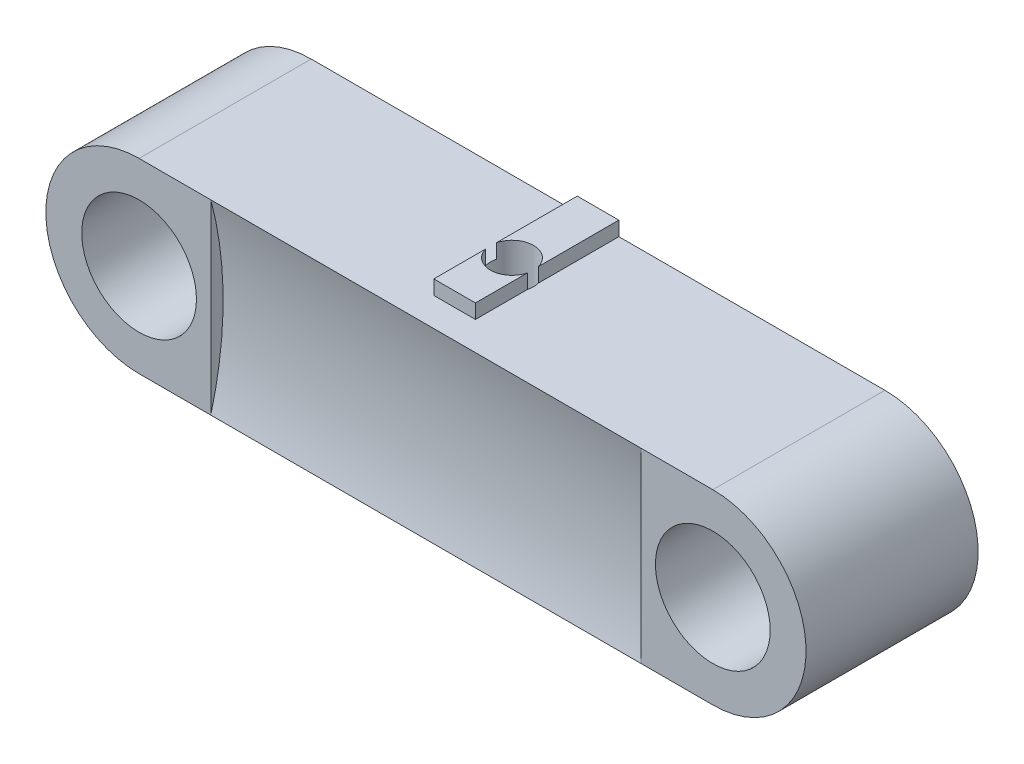
ISO-10303-21;
HEADER;
FILE_DESCRIPTION(('STEP AP214'),'2;1');
FILE_NAME('part.step','',(''),(''),'','','');
FILE_SCHEMA(('AUTOMOTIVE_DESIGN { 1 0 10303 214 1 1 1 1 }'));
ENDSEC;
DATA;
#1=APPLICATION_CONTEXT('core data for automotive mechanical design processes');
#2=APPLICATION_PROTOCOL_DEFINITION('international standard','automotive_design',2000,#1);
#3=PRODUCT_CONTEXT('',#1,'mechanical');
#4=PRODUCT('Part','Part','',(#3));
#5=PRODUCT_RELATED_PRODUCT_CATEGORY('part','',(#4));
#6=PRODUCT_DEFINITION_FORMATION('','',#4);
#7=PRODUCT_DEFINITION_CONTEXT('part definition',#1,'design');
#8=PRODUCT_DEFINITION('design','',#6,#7);
#9=PRODUCT_DEFINITION_SHAPE('','',#8);
#10=(LENGTH_UNIT() NAMED_UNIT(*) SI_UNIT(.MILLI.,.METRE.));
#11=(NAMED_UNIT(*) PLANE_ANGLE_UNIT() SI_UNIT($,.RADIAN.));
#12=(NAMED_UNIT(*) SI_UNIT($,.STERADIAN.) SOLID_ANGLE_UNIT());
#13=UNCERTAINTY_MEASURE_WITH_UNIT(LENGTH_MEASURE(1.E-05),#10,'distance_accuracy_value','');
#14=(GEOMETRIC_REPRESENTATION_CONTEXT(3) GLOBAL_UNCERTAINTY_ASSIGNED_CONTEXT((#13)) GLOBAL_UNIT_ASSIGNED_CONTEXT((#10,
#11,#12)) REPRESENTATION_CONTEXT('',''));
#15=CARTESIAN_POINT('',(0.,0.,0.));
#16=DIRECTION('',(0.,0.,1.));
#17=DIRECTION('',(1.,0.,0.));
#18=AXIS2_PLACEMENT_3D('',#15,#16,#17);
#19=CARTESIAN_POINT('',(-1.45,7.5,-6.));
#20=DIRECTION('',(1.,0.,0.));
#21=DIRECTION('',(0.,0.,-1.));
#22=AXIS2_PLACEMENT_3D('',#19,#20,#21);
#23=PLANE('',#22);
#24=DIRECTION('',(0.,0.,1.));
#25=VECTOR('',#24,1.);
#26=CARTESIAN_POINT('',(-1.45,6.5,6.));
#27=LINE('',#26,#25);
#28=CARTESIAN_POINT('',(-1.45,6.5,-6.));
#29=VERTEX_POINT('',#28);
#30=CARTESIAN_POINT('',(-1.45,6.5,-0.384057287393435));
#31=VERTEX_POINT('',#30);
#32=EDGE_CURVE('E138',#29,#31,#27,.T.);
#33=ORIENTED_EDGE('',*,*,#32,.T.);
#34=DIRECTION('',(0.,1.,0.));
#35=VECTOR('',#34,1.);
#36=CARTESIAN_POINT('',(-1.45,-6.5,-0.384057287393429));
#37=LINE('',#36,#35);
#38=CARTESIAN_POINT('',(-1.45,7.5,-0.384057287393429));
#39=VERTEX_POINT('',#38);
#40=EDGE_CURVE('E244',#31,#39,#37,.T.);
#41=ORIENTED_EDGE('',*,*,#40,.T.);
#42=DIRECTION('',(0.,0.,1.));
#43=VECTOR('',#42,1.);
#44=CARTESIAN_POINT('',(-1.45,7.5,-6.));
#45=LINE('',#44,#43);
#46=CARTESIAN_POINT('',(-1.45,7.5,-6.));
#47=VERTEX_POINT('',#46);
#48=EDGE_CURVE('E298',#47,#39,#45,.T.);
#49=ORIENTED_EDGE('',*,*,#48,.F.);
#50=DIRECTION('',(0.,-1.,0.));
#51=VECTOR('',#50,1.);
#52=CARTESIAN_POINT('',(-1.45,7.5,-6.));
#53=LINE('',#52,#51);
#54=EDGE_CURVE('E155',#47,#29,#53,.T.);
#55=ORIENTED_EDGE('',*,*,#54,.T.);
#56=EDGE_LOOP('',(#33,#41,#49,#55));
#57=FACE_BOUND('',#56,.T.);
#58=ADVANCED_FACE('F33',(#57),#23,.F.);
#59=CARTESIAN_POINT('',(1.45,7.5,-6.));
#60=DIRECTION('',(-1.,0.,0.));
#61=DIRECTION('',(0.,0.,1.));
#62=AXIS2_PLACEMENT_3D('',#59,#60,#61);
#63=PLANE('',#62);
#64=DIRECTION('',(0.,0.,-1.));
#65=VECTOR('',#64,1.);
#66=CARTESIAN_POINT('',(1.45,6.5,6.));
#67=LINE('',#66,#65);
#68=CARTESIAN_POINT('',(1.45,6.5,4.));
#69=VERTEX_POINT('',#68);
#70=CARTESIAN_POINT('',(1.45,6.5,0.384057287393435));
#71=VERTEX_POINT('',#70);
#72=EDGE_CURVE('E145',#69,#71,#67,.T.);
#73=ORIENTED_EDGE('',*,*,#72,.T.);
#74=DIRECTION('',(0.,1.,0.));
#75=VECTOR('',#74,1.);
#76=CARTESIAN_POINT('',(1.45,-6.5,0.384057287393428));
#77=LINE('',#76,#75);
#78=CARTESIAN_POINT('',(1.45,7.5,0.384057287393428));
#79=VERTEX_POINT('',#78);
#80=EDGE_CURVE('E133',#71,#79,#77,.T.);
#81=ORIENTED_EDGE('',*,*,#80,.T.);
#82=DIRECTION('',(0.,0.,-1.));
#83=VECTOR('',#82,1.);
#84=CARTESIAN_POINT('',(1.45,7.5,-6.));
#85=LINE('',#84,#83);
#86=CARTESIAN_POINT('',(1.45,7.5,4.));
#87=VERTEX_POINT('',#86);
#88=EDGE_CURVE('E144',#87,#79,#85,.T.);
#89=ORIENTED_EDGE('',*,*,#88,.F.);
#90=DIRECTION('',(0.,-1.,0.));
#91=VECTOR('',#90,1.);
#92=CARTESIAN_POINT('',(1.45,7.5,4.));
#93=LINE('',#92,#91);
#94=EDGE_CURVE('E165',#87,#69,#93,.T.);
#95=ORIENTED_EDGE('',*,*,#94,.T.);
#96=EDGE_LOOP('',(#73,#81,#89,#95));
#97=FACE_BOUND('',#96,.T.);
#98=ADVANCED_FACE('F142',(#97),#63,.F.);
#99=CARTESIAN_POINT('',(0.,7.5,0.));
#100=DIRECTION('',(0.,1.,0.));
#101=DIRECTION('',(0.,0.,1.));
#102=AXIS2_PLACEMENT_3D('',#99,#100,#101);
#103=PLANE('',#102);
#104=CARTESIAN_POINT('',(0.,7.5,0.));
#105=DIRECTION('',(0.,1.,0.));
#106=DIRECTION('',(0.,0.,1.));
#107=AXIS2_PLACEMENT_3D('',#104,#105,#106);
#108=CIRCLE('',#107,1.5);
#109=CARTESIAN_POINT('',(1.45,7.5,-0.384057287393429));
#110=VERTEX_POINT('',#109);
#111=EDGE_CURVE('E11',#110,#39,#108,.T.);
#112=ORIENTED_EDGE('',*,*,#111,.F.);
#113=CARTESIAN_POINT('',(1.45,7.5,-6.));
#114=VERTEX_POINT('',#113);
#115=EDGE_CURVE('E153',#110,#114,#85,.T.);
#116=ORIENTED_EDGE('',*,*,#115,.T.);
#117=DIRECTION('',(-1.,0.,0.));
#118=VECTOR('',#117,1.);
#119=CARTESIAN_POINT('',(-1.45,7.5,-6.));
#120=LINE('',#119,#118);
#121=EDGE_CURVE('E152',#114,#47,#120,.T.);
#122=ORIENTED_EDGE('',*,*,#121,.T.);
#123=ORIENTED_EDGE('',*,*,#48,.T.);
#124=EDGE_LOOP('',(#112,#116,#122,#123));
#125=FACE_BOUND('',#124,.T.);
#126=ADVANCED_FACE('F277',(#125),#103,.T.);
#127=CARTESIAN_POINT('',(-20.,6.5,6.));
#128=DIRECTION('',(0.,-1.,0.));
#129=DIRECTION('',(1.,0.,0.));
#130=AXIS2_PLACEMENT_3D('',#127,#128,#129);
#131=PLANE('',#130);
#132=CARTESIAN_POINT('',(-1.45,6.5,0.384057287393428));
#133=VERTEX_POINT('',#132);
#134=CARTESIAN_POINT('',(-1.45,6.5,4.));
#135=VERTEX_POINT('',#134);
#136=EDGE_CURVE('E55',#133,#135,#27,.T.);
#137=ORIENTED_EDGE('',*,*,#136,.F.);
#138=CARTESIAN_POINT('',(0.,6.5,0.));
#139=DIRECTION('',(0.,-1.,0.));
#140=DIRECTION('',(1.,0.,0.));
#141=AXIS2_PLACEMENT_3D('',#138,#139,#140);
#142=CIRCLE('',#141,1.5);
#143=EDGE_CURVE('E251',#133,#31,#142,.T.);
#144=ORIENTED_EDGE('',*,*,#143,.T.);
#145=ORIENTED_EDGE('',*,*,#32,.F.);
#146=DIRECTION('',(-1.,0.,0.));
#147=VECTOR('',#146,1.);
#148=CARTESIAN_POINT('',(-20.,6.5,-6.));
#149=LINE('',#148,#147);
#150=CARTESIAN_POINT('',(-20.,6.5,-6.));
#151=VERTEX_POINT('',#150);
#152=EDGE_CURVE('E221',#29,#151,#149,.T.);
#153=ORIENTED_EDGE('',*,*,#152,.T.);
#154=DIRECTION('',(0.,0.,-1.));
#155=VECTOR('',#154,1.);
#156=CARTESIAN_POINT('',(-20.,6.5,6.));
#157=LINE('',#156,#155);
#158=CARTESIAN_POINT('',(-20.,6.5,6.));
#159=VERTEX_POINT('',#158);
#160=EDGE_CURVE('E214',#159,#151,#157,.T.);
#161=ORIENTED_EDGE('',*,*,#160,.F.);
#162=DIRECTION('',(-1.,0.,0.));
#163=VECTOR('',#162,1.);
#164=CARTESIAN_POINT('',(-20.,6.5,6.));
#165=LINE('',#164,#163);
#166=CARTESIAN_POINT('',(-15.,6.5,6.));
#167=VERTEX_POINT('',#166);
#168=EDGE_CURVE('E210',#167,#159,#165,.T.);
#169=ORIENTED_EDGE('',*,*,#168,.F.);
#170=DIRECTION('',(1.,0.,0.));
#171=VECTOR('',#170,1.);
#172=CARTESIAN_POINT('',(-15.,6.5,6.));
#173=LINE('',#172,#171);
#174=CARTESIAN_POINT('',(15.,6.50000000000001,6.));
#175=VERTEX_POINT('',#174);
#176=EDGE_CURVE('E178',#167,#175,#173,.T.);
#177=ORIENTED_EDGE('',*,*,#176,.T.);
#178=CARTESIAN_POINT('',(20.,6.50000000000001,6.));
#179=VERTEX_POINT('',#178);
#180=EDGE_CURVE('E211',#179,#175,#165,.T.);
#181=ORIENTED_EDGE('',*,*,#180,.F.);
#182=DIRECTION('',(0.,0.,-1.));
#183=VECTOR('',#182,1.);
#184=CARTESIAN_POINT('',(20.,6.50000000000001,6.));
#185=LINE('',#184,#183);
#186=CARTESIAN_POINT('',(20.,6.50000000000001,-6.));
#187=VERTEX_POINT('',#186);
#188=EDGE_CURVE('E226',#179,#187,#185,.T.);
#189=ORIENTED_EDGE('',*,*,#188,.T.);
#190=CARTESIAN_POINT('',(1.45,6.5,-6.));
#191=VERTEX_POINT('',#190);
#192=EDGE_CURVE('E204',#187,#191,#149,.T.);
#193=ORIENTED_EDGE('',*,*,#192,.T.);
#194=CARTESIAN_POINT('',(1.45,6.5,-0.384057287393429));
#195=VERTEX_POINT('',#194);
#196=EDGE_CURVE('E235',#195,#191,#67,.T.);
#197=ORIENTED_EDGE('',*,*,#196,.F.);
#198=EDGE_CURVE('E146',#195,#71,#142,.T.);
#199=ORIENTED_EDGE('',*,*,#198,.T.);
#200=ORIENTED_EDGE('',*,*,#72,.F.);
#201=DIRECTION('',(1.,0.,0.));
#202=VECTOR('',#201,1.);
#203=CARTESIAN_POINT('',(-20.,6.5,4.));
#204=LINE('',#203,#202);
#205=EDGE_CURVE('E237',#135,#69,#204,.T.);
#206=ORIENTED_EDGE('',*,*,#205,.F.);
#207=EDGE_LOOP('',(#137,#144,#145,#153,#161,#169,#177,#181,#189,#193,#197,#199,#200,#206));
#208=FACE_BOUND('',#207,.T.);
#209=ADVANCED_FACE('F249',(#208),#131,.F.);
#210=CARTESIAN_POINT('',(-20.,0.,6.));
#211=DIRECTION('',(0.,0.,1.));
#212=DIRECTION('',(1.,0.,0.));
#213=AXIS2_PLACEMENT_3D('',#210,#211,#212);
#214=PLANE('',#213);
#215=CARTESIAN_POINT('',(-20.,0.,6.));
#216=DIRECTION('',(0.,0.,1.));
#217=DIRECTION('',(1.,0.,0.));
#218=AXIS2_PLACEMENT_3D('',#215,#216,#217);
#219=CIRCLE('',#218,4.);
#220=CARTESIAN_POINT('',(-16.,0.,6.));
#221=VERTEX_POINT('',#220);
#222=EDGE_CURVE('E194',#221,#221,#219,.T.);
#223=ORIENTED_EDGE('',*,*,#222,.F.);
#224=EDGE_LOOP('',(#223));
#225=FACE_BOUND('',#224,.T.);
#226=DIRECTION('',(1.,0.,0.));
#227=VECTOR('',#226,1.);
#228=CARTESIAN_POINT('',(-20.,-6.5,6.));
#229=LINE('',#228,#227);
#230=CARTESIAN_POINT('',(-20.,-6.5,6.));
#231=VERTEX_POINT('',#230);
#232=CARTESIAN_POINT('',(-15.,-6.5,6.));
#233=VERTEX_POINT('',#232);
#234=EDGE_CURVE('E205',#231,#233,#229,.T.);
#235=ORIENTED_EDGE('',*,*,#234,.T.);
#236=DIRECTION('',(0.,-1.,0.));
#237=VECTOR('',#236,1.);
#238=CARTESIAN_POINT('',(-15.,6.5,6.));
#239=LINE('',#238,#237);
#240=EDGE_CURVE('E174',#167,#233,#239,.T.);
#241=ORIENTED_EDGE('',*,*,#240,.F.);
#242=ORIENTED_EDGE('',*,*,#168,.T.);
#243=CARTESIAN_POINT('',(-20.,0.,6.));
#244=DIRECTION('',(0.,0.,1.));
#245=DIRECTION('',(1.,0.,0.));
#246=AXIS2_PLACEMENT_3D('',#243,#244,#245);
#247=CIRCLE('',#246,6.5);
#248=EDGE_CURVE('E200',#159,#231,#247,.T.);
#249=ORIENTED_EDGE('',*,*,#248,.T.);
#250=EDGE_LOOP('',(#235,#241,#242,#249));
#251=FACE_BOUND('',#250,.T.);
#252=ADVANCED_FACE('F315',(#225,#251),#214,.T.);
#253=DIRECTION('',(0.,-1.,0.));
#254=VECTOR('',#253,1.);
#255=CARTESIAN_POINT('',(15.,6.5,6.));
#256=LINE('',#255,#254);
#257=CARTESIAN_POINT('',(15.,-6.5,6.));
#258=VERTEX_POINT('',#257);
#259=EDGE_CURVE('E175',#175,#258,#256,.T.);
#260=ORIENTED_EDGE('',*,*,#259,.T.);
#261=CARTESIAN_POINT('',(20.,-6.49999999999999,6.));
#262=VERTEX_POINT('',#261);
#263=EDGE_CURVE('E203',#258,#262,#229,.T.);
#264=ORIENTED_EDGE('',*,*,#263,.T.);
#265=CARTESIAN_POINT('',(20.,0.,6.));
#266=DIRECTION('',(0.,0.,1.));
#267=DIRECTION('',(1.,0.,0.));
#268=AXIS2_PLACEMENT_3D('',#265,#266,#267);
#269=CIRCLE('',#268,6.5);
#270=EDGE_CURVE('E208',#262,#179,#269,.T.);
#271=ORIENTED_EDGE('',*,*,#270,.T.);
#272=ORIENTED_EDGE('',*,*,#180,.T.);
#273=EDGE_LOOP('',(#260,#264,#271,#272));
#274=FACE_BOUND('',#273,.T.);
#275=CARTESIAN_POINT('',(20.,0.,6.));
#276=DIRECTION('',(0.,0.,1.));
#277=DIRECTION('',(1.,0.,0.));
#278=AXIS2_PLACEMENT_3D('',#275,#276,#277);
#279=CIRCLE('',#278,4.);
#280=CARTESIAN_POINT('',(24.,0.,6.));
#281=VERTEX_POINT('',#280);
#282=EDGE_CURVE('E188',#281,#281,#279,.T.);
#283=ORIENTED_EDGE('',*,*,#282,.F.);
#284=EDGE_LOOP('',(#283));
#285=FACE_BOUND('',#284,.T.);
#286=ADVANCED_FACE('F324',(#274,#285),#214,.T.);
#287=CARTESIAN_POINT('',(-20.,0.,-6.));
#288=DIRECTION('',(0.,0.,1.));
#289=DIRECTION('',(1.,0.,0.));
#290=AXIS2_PLACEMENT_3D('',#287,#288,#289);
#291=PLANE('',#290);
#292=ORIENTED_EDGE('',*,*,#152,.F.);
#293=ORIENTED_EDGE('',*,*,#54,.F.);
#294=ORIENTED_EDGE('',*,*,#121,.F.);
#295=DIRECTION('',(0.,-1.,0.));
#296=VECTOR('',#295,1.);
#297=CARTESIAN_POINT('',(1.45,7.5,-6.));
#298=LINE('',#297,#296);
#299=EDGE_CURVE('E162',#114,#191,#298,.T.);
#300=ORIENTED_EDGE('',*,*,#299,.T.);
#301=ORIENTED_EDGE('',*,*,#192,.F.);
#302=CARTESIAN_POINT('',(20.,0.,-6.));
#303=DIRECTION('',(0.,0.,1.));
#304=DIRECTION('',(1.,0.,0.));
#305=AXIS2_PLACEMENT_3D('',#302,#303,#304);
#306=CIRCLE('',#305,6.5);
#307=CARTESIAN_POINT('',(20.,-6.49999999999999,-6.));
#308=VERTEX_POINT('',#307);
#309=EDGE_CURVE('E219',#308,#187,#306,.T.);
#310=ORIENTED_EDGE('',*,*,#309,.F.);
#311=DIRECTION('',(1.,0.,0.));
#312=VECTOR('',#311,1.);
#313=CARTESIAN_POINT('',(-20.,-6.5,-6.));
#314=LINE('',#313,#312);
#315=CARTESIAN_POINT('',(-20.,-6.5,-6.));
#316=VERTEX_POINT('',#315);
#317=EDGE_CURVE('E217',#316,#308,#314,.T.);
#318=ORIENTED_EDGE('',*,*,#317,.F.);
#319=CARTESIAN_POINT('',(-20.,0.,-6.));
#320=DIRECTION('',(0.,0.,1.));
#321=DIRECTION('',(1.,0.,0.));
#322=AXIS2_PLACEMENT_3D('',#319,#320,#321);
#323=CIRCLE('',#322,6.5);
#324=EDGE_CURVE('E197',#151,#316,#323,.T.);
#325=ORIENTED_EDGE('',*,*,#324,.F.);
#326=EDGE_LOOP('',(#292,#293,#294,#300,#301,#310,#318,#325));
#327=FACE_BOUND('',#326,.T.);
#328=CARTESIAN_POINT('',(20.,0.,-6.));
#329=DIRECTION('',(0.,0.,1.));
#330=DIRECTION('',(1.,0.,0.));
#331=AXIS2_PLACEMENT_3D('',#328,#329,#330);
#332=CIRCLE('',#331,4.);
#333=CARTESIAN_POINT('',(24.,0.,-6.));
#334=VERTEX_POINT('',#333);
#335=EDGE_CURVE('E185',#334,#334,#332,.T.);
#336=ORIENTED_EDGE('',*,*,#335,.T.);
#337=EDGE_LOOP('',(#336));
#338=FACE_BOUND('',#337,.T.);
#339=CARTESIAN_POINT('',(-20.,0.,-6.));
#340=DIRECTION('',(0.,0.,1.));
#341=DIRECTION('',(1.,0.,0.));
#342=AXIS2_PLACEMENT_3D('',#339,#340,#341);
#343=CIRCLE('',#342,4.);
#344=CARTESIAN_POINT('',(-16.,0.,-6.));
#345=VERTEX_POINT('',#344);
#346=EDGE_CURVE('E191',#345,#345,#343,.T.);
#347=ORIENTED_EDGE('',*,*,#346,.T.);
#348=EDGE_LOOP('',(#347));
#349=FACE_BOUND('',#348,.T.);
#350=ADVANCED_FACE('F304',(#327,#338,#349),#291,.F.);
#351=CARTESIAN_POINT('',(-20.,0.,6.));
#352=DIRECTION('',(0.,0.,-1.));
#353=DIRECTION('',(-1.,0.,0.));
#354=AXIS2_PLACEMENT_3D('',#351,#352,#353);
#355=CYLINDRICAL_SURFACE('',#354,6.5);
#356=ORIENTED_EDGE('',*,*,#324,.T.);
#357=DIRECTION('',(0.,0.,-1.));
#358=VECTOR('',#357,1.);
#359=CARTESIAN_POINT('',(-20.,-6.5,6.));
#360=LINE('',#359,#358);
#361=EDGE_CURVE('E232',#231,#316,#360,.T.);
#362=ORIENTED_EDGE('',*,*,#361,.F.);
#363=ORIENTED_EDGE('',*,*,#248,.F.);
#364=ORIENTED_EDGE('',*,*,#160,.T.);
#365=EDGE_LOOP('',(#356,#362,#363,#364));
#366=FACE_BOUND('',#365,.T.);
#367=ADVANCED_FACE('F35',(#366),#355,.T.);
#368=CARTESIAN_POINT('',(-20.,-6.5,6.));
#369=DIRECTION('',(0.,1.,0.));
#370=DIRECTION('',(-1.,0.,0.));
#371=AXIS2_PLACEMENT_3D('',#368,#369,#370);
#372=PLANE('',#371);
#373=CARTESIAN_POINT('',(0.,-6.5,0.));
#374=DIRECTION('',(0.,1.,0.));
#375=DIRECTION('',(0.,0.,1.));
#376=AXIS2_PLACEMENT_3D('',#373,#374,#375);
#377=CIRCLE('',#376,1.5);
#378=CARTESIAN_POINT('',(0.,-6.5,1.5));
#379=VERTEX_POINT('',#378);
#380=EDGE_CURVE('E260',#379,#379,#377,.T.);
#381=ORIENTED_EDGE('',*,*,#380,.T.);
#382=EDGE_LOOP('',(#381));
#383=FACE_BOUND('',#382,.T.);
#384=ORIENTED_EDGE('',*,*,#317,.T.);
#385=DIRECTION('',(0.,0.,-1.));
#386=VECTOR('',#385,1.);
#387=CARTESIAN_POINT('',(20.,-6.49999999999999,6.));
#388=LINE('',#387,#386);
#389=EDGE_CURVE('E229',#262,#308,#388,.T.);
#390=ORIENTED_EDGE('',*,*,#389,.F.);
#391=ORIENTED_EDGE('',*,*,#263,.F.);
#392=DIRECTION('',(1.,0.,0.));
#393=VECTOR('',#392,1.);
#394=CARTESIAN_POINT('',(-15.,-6.5,6.));
#395=LINE('',#394,#393);
#396=EDGE_CURVE('E183',#233,#258,#395,.T.);
#397=ORIENTED_EDGE('',*,*,#396,.F.);
#398=ORIENTED_EDGE('',*,*,#234,.F.);
#399=ORIENTED_EDGE('',*,*,#361,.T.);
#400=EDGE_LOOP('',(#384,#390,#391,#397,#398,#399));
#401=FACE_BOUND('',#400,.T.);
#402=ADVANCED_FACE('F267',(#383,#401),#372,.F.);
#403=CARTESIAN_POINT('',(20.,0.,6.));
#404=DIRECTION('',(0.,0.,-1.));
#405=DIRECTION('',(-1.,0.,0.));
#406=AXIS2_PLACEMENT_3D('',#403,#404,#405);
#407=CYLINDRICAL_SURFACE('',#406,6.5);
#408=ORIENTED_EDGE('',*,*,#309,.T.);
#409=ORIENTED_EDGE('',*,*,#188,.F.);
#410=ORIENTED_EDGE('',*,*,#270,.F.);
#411=ORIENTED_EDGE('',*,*,#389,.T.);
#412=EDGE_LOOP('',(#408,#409,#410,#411));
#413=FACE_BOUND('',#412,.T.);
#414=ADVANCED_FACE('F378',(#413),#407,.T.);
#415=CARTESIAN_POINT('',(-20.,0.,6.));
#416=DIRECTION('',(0.,0.,-1.));
#417=DIRECTION('',(-1.,0.,0.));
#418=AXIS2_PLACEMENT_3D('',#415,#416,#417);
#419=CYLINDRICAL_SURFACE('',#418,4.);
#420=ORIENTED_EDGE('',*,*,#222,.T.);
#421=EDGE_LOOP('',(#420));
#422=FACE_BOUND('',#421,.T.);
#423=ORIENTED_EDGE('',*,*,#346,.F.);
#424=EDGE_LOOP('',(#423));
#425=FACE_BOUND('',#424,.T.);
#426=ADVANCED_FACE('F445',(#422,#425),#419,.F.);
#427=CARTESIAN_POINT('',(20.,0.,6.));
#428=DIRECTION('',(0.,0.,-1.));
#429=DIRECTION('',(-1.,0.,0.));
#430=AXIS2_PLACEMENT_3D('',#427,#428,#429);
#431=CYLINDRICAL_SURFACE('',#430,4.);
#432=ORIENTED_EDGE('',*,*,#282,.T.);
#433=EDGE_LOOP('',(#432));
#434=FACE_BOUND('',#433,.T.);
#435=ORIENTED_EDGE('',*,*,#335,.F.);
#436=EDGE_LOOP('',(#435));
#437=FACE_BOUND('',#436,.T.);
#438=ADVANCED_FACE('F422',(#434,#437),#431,.F.);
#439=CARTESIAN_POINT('',(-15.,0.,30.1402154091466));
#440=DIRECTION('',(1.,0.,0.));
#441=DIRECTION('',(0.,0.,-1.));
#442=AXIS2_PLACEMENT_3D('',#439,#440,#441);
#443=CYLINDRICAL_SURFACE('',#442,25.);
#444=CARTESIAN_POINT('',(15.,0.,30.1402154091466));
#445=DIRECTION('',(1.,0.,0.));
#446=DIRECTION('',(0.,0.,-1.));
#447=AXIS2_PLACEMENT_3D('',#444,#445,#446);
#448=CIRCLE('',#447,25.);
#449=EDGE_CURVE('E170',#258,#175,#448,.T.);
#450=ORIENTED_EDGE('',*,*,#449,.T.);
#451=ORIENTED_EDGE('',*,*,#176,.F.);
#452=CARTESIAN_POINT('',(-15.,0.,30.1402154091466));
#453=DIRECTION('',(1.,0.,0.));
#454=DIRECTION('',(0.,0.,-1.));
#455=AXIS2_PLACEMENT_3D('',#452,#453,#454);
#456=CIRCLE('',#455,25.);
#457=EDGE_CURVE('E171',#233,#167,#456,.T.);
#458=ORIENTED_EDGE('',*,*,#457,.F.);
#459=ORIENTED_EDGE('',*,*,#396,.T.);
#460=EDGE_LOOP('',(#450,#451,#458,#459));
#461=FACE_BOUND('',#460,.T.);
#462=ADVANCED_FACE('F322',(#461),#443,.F.);
#463=CARTESIAN_POINT('',(-15.,0.,30.1402154091466));
#464=DIRECTION('',(1.,0.,0.));
#465=DIRECTION('',(0.,0.,-1.));
#466=AXIS2_PLACEMENT_3D('',#463,#464,#465);
#467=PLANE('',#466);
#468=ORIENTED_EDGE('',*,*,#457,.T.);
#469=ORIENTED_EDGE('',*,*,#240,.T.);
#470=EDGE_LOOP('',(#468,#469));
#471=FACE_BOUND('',#470,.T.);
#472=ADVANCED_FACE('F295',(#471),#467,.T.);
#473=CARTESIAN_POINT('',(15.,0.,30.1402154091466));
#474=DIRECTION('',(1.,0.,0.));
#475=DIRECTION('',(0.,0.,-1.));
#476=AXIS2_PLACEMENT_3D('',#473,#474,#475);
#477=PLANE('',#476);
#478=ORIENTED_EDGE('',*,*,#449,.F.);
#479=ORIENTED_EDGE('',*,*,#259,.F.);
#480=EDGE_LOOP('',(#478,#479));
#481=FACE_BOUND('',#480,.T.);
#482=ADVANCED_FACE('F289',(#481),#477,.F.);
#483=CARTESIAN_POINT('',(-1.45,7.5,0.384057287393428));
#484=VERTEX_POINT('',#483);
#485=CARTESIAN_POINT('',(-1.45,7.5,4.));
#486=VERTEX_POINT('',#485);
#487=EDGE_CURVE('E253',#484,#486,#45,.T.);
#488=ORIENTED_EDGE('',*,*,#487,.F.);
#489=DIRECTION('',(0.,1.,0.));
#490=VECTOR('',#489,1.);
#491=CARTESIAN_POINT('',(-1.45,-6.5,0.384057287393428));
#492=LINE('',#491,#490);
#493=EDGE_CURVE('E48',#484,#133,#492,.F.);
#494=ORIENTED_EDGE('',*,*,#493,.T.);
#495=ORIENTED_EDGE('',*,*,#136,.T.);
#496=DIRECTION('',(0.,-1.,0.));
#497=VECTOR('',#496,1.);
#498=CARTESIAN_POINT('',(-1.45,7.5,4.));
#499=LINE('',#498,#497);
#500=EDGE_CURVE('E167',#486,#135,#499,.T.);
#501=ORIENTED_EDGE('',*,*,#500,.F.);
#502=EDGE_LOOP('',(#488,#494,#495,#501));
#503=FACE_BOUND('',#502,.T.);
#504=ADVANCED_FACE('F280',(#503),#23,.F.);
#505=CARTESIAN_POINT('',(-1.45,7.5,4.));
#506=DIRECTION('',(0.,0.,-1.));
#507=DIRECTION('',(-1.,0.,0.));
#508=AXIS2_PLACEMENT_3D('',#505,#506,#507);
#509=PLANE('',#508);
#510=ORIENTED_EDGE('',*,*,#500,.T.);
#511=ORIENTED_EDGE('',*,*,#205,.T.);
#512=ORIENTED_EDGE('',*,*,#94,.F.);
#513=DIRECTION('',(1.,0.,0.));
#514=VECTOR('',#513,1.);
#515=CARTESIAN_POINT('',(-1.45,7.5,4.));
#516=LINE('',#515,#514);
#517=EDGE_CURVE('E150',#486,#87,#516,.T.);
#518=ORIENTED_EDGE('',*,*,#517,.F.);
#519=EDGE_LOOP('',(#510,#511,#512,#518));
#520=FACE_BOUND('',#519,.T.);
#521=ADVANCED_FACE('F288',(#520),#509,.F.);
#522=ORIENTED_EDGE('',*,*,#115,.F.);
#523=DIRECTION('',(0.,1.,0.));
#524=VECTOR('',#523,1.);
#525=CARTESIAN_POINT('',(1.45,-6.5,-0.384057287393429));
#526=LINE('',#525,#524);
#527=EDGE_CURVE('E257',#110,#195,#526,.F.);
#528=ORIENTED_EDGE('',*,*,#527,.T.);
#529=ORIENTED_EDGE('',*,*,#196,.T.);
#530=ORIENTED_EDGE('',*,*,#299,.F.);
#531=EDGE_LOOP('',(#522,#528,#529,#530));
#532=FACE_BOUND('',#531,.T.);
#533=ADVANCED_FACE('F275',(#532),#63,.F.);
#534=EDGE_CURVE('E37',#484,#79,#108,.T.);
#535=ORIENTED_EDGE('',*,*,#534,.F.);
#536=ORIENTED_EDGE('',*,*,#487,.T.);
#537=ORIENTED_EDGE('',*,*,#517,.T.);
#538=ORIENTED_EDGE('',*,*,#88,.T.);
#539=EDGE_LOOP('',(#535,#536,#537,#538));
#540=FACE_BOUND('',#539,.T.);
#541=ADVANCED_FACE('F148',(#540),#103,.T.);
#542=CARTESIAN_POINT('',(0.,-6.5,0.));
#543=DIRECTION('',(0.,1.,0.));
#544=DIRECTION('',(0.,0.,1.));
#545=AXIS2_PLACEMENT_3D('',#542,#543,#544);
#546=CYLINDRICAL_SURFACE('',#545,1.5);
#547=ORIENTED_EDGE('',*,*,#380,.F.);
#548=EDGE_LOOP('',(#547));
#549=FACE_BOUND('',#548,.T.);
#550=ORIENTED_EDGE('',*,*,#143,.F.);
#551=ORIENTED_EDGE('',*,*,#493,.F.);
#552=ORIENTED_EDGE('',*,*,#534,.T.);
#553=ORIENTED_EDGE('',*,*,#80,.F.);
#554=ORIENTED_EDGE('',*,*,#198,.F.);
#555=ORIENTED_EDGE('',*,*,#527,.F.);
#556=ORIENTED_EDGE('',*,*,#111,.T.);
#557=ORIENTED_EDGE('',*,*,#40,.F.);
#558=EDGE_LOOP('',(#550,#551,#552,#553,#554,#555,#556,#557));
#559=FACE_BOUND('',#558,.T.);
#560=ADVANCED_FACE('F132',(#549,#559),#546,.F.);
#561=CLOSED_SHELL('',(#58,#98,#126,#209,#252,#286,#350,#367,#402,#414,#426,#438,#462,#472,#482,
#504,#521,#533,#541,#560));
#562=MANIFOLD_SOLID_BREP('B2',#561);
#563=ADVANCED_BREP_SHAPE_REPRESENTATION('',(#18,#562),#14);
#564=SHAPE_DEFINITION_REPRESENTATION(#9,#563);
ENDSEC;
END-ISO-10303-21;
